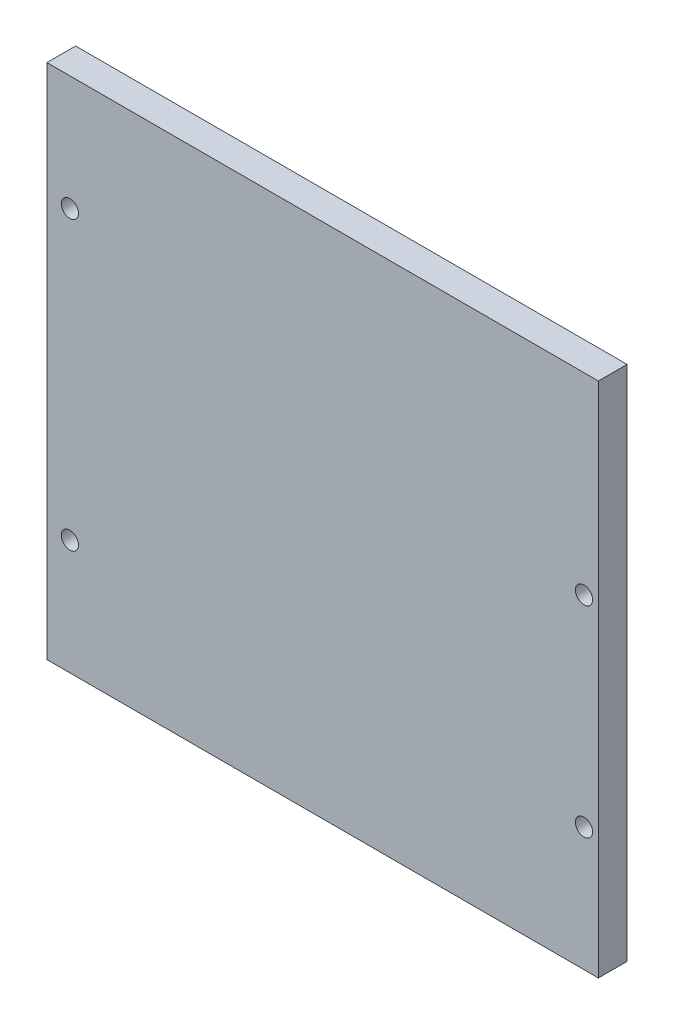
ISO-10303-21;
HEADER;
FILE_DESCRIPTION(('STEP AP214'),'2;1');
FILE_NAME('part.step','',(''),(''),'','','');
FILE_SCHEMA(('AUTOMOTIVE_DESIGN { 1 0 10303 214 1 1 1 1 }'));
ENDSEC;
DATA;
#1=APPLICATION_CONTEXT('core data for automotive mechanical design processes');
#2=APPLICATION_PROTOCOL_DEFINITION('international standard','automotive_design',2000,#1);
#3=PRODUCT_CONTEXT('',#1,'mechanical');
#4=PRODUCT('Part','Part','',(#3));
#5=PRODUCT_RELATED_PRODUCT_CATEGORY('part','',(#4));
#6=PRODUCT_DEFINITION_FORMATION('','',#4);
#7=PRODUCT_DEFINITION_CONTEXT('part definition',#1,'design');
#8=PRODUCT_DEFINITION('design','',#6,#7);
#9=PRODUCT_DEFINITION_SHAPE('','',#8);
#10=(LENGTH_UNIT() NAMED_UNIT(*) SI_UNIT(.MILLI.,.METRE.));
#11=(NAMED_UNIT(*) PLANE_ANGLE_UNIT() SI_UNIT($,.RADIAN.));
#12=(NAMED_UNIT(*) SI_UNIT($,.STERADIAN.) SOLID_ANGLE_UNIT());
#13=UNCERTAINTY_MEASURE_WITH_UNIT(LENGTH_MEASURE(1.E-05),#10,'distance_accuracy_value','');
#14=(GEOMETRIC_REPRESENTATION_CONTEXT(3) GLOBAL_UNCERTAINTY_ASSIGNED_CONTEXT((#13)) GLOBAL_UNIT_ASSIGNED_CONTEXT((#10,
#11,#12)) REPRESENTATION_CONTEXT('',''));
#15=CARTESIAN_POINT('',(0.,0.,0.));
#16=DIRECTION('',(0.,0.,1.));
#17=DIRECTION('',(1.,0.,0.));
#18=AXIS2_PLACEMENT_3D('',#15,#16,#17);
#19=CARTESIAN_POINT('',(48.,45.,5.));
#20=DIRECTION('',(-1.,0.,0.));
#21=DIRECTION('',(0.,-1.,0.));
#22=AXIS2_PLACEMENT_3D('',#19,#20,#21);
#23=PLANE('',#22);
#24=DIRECTION('',(0.,1.,0.));
#25=VECTOR('',#24,1.);
#26=CARTESIAN_POINT('',(48.,45.,0.));
#27=LINE('',#26,#25);
#28=CARTESIAN_POINT('',(48.,-45.,0.));
#29=VERTEX_POINT('',#28);
#30=CARTESIAN_POINT('',(48.,45.,0.));
#31=VERTEX_POINT('',#30);
#32=EDGE_CURVE('E107',#29,#31,#27,.T.);
#33=ORIENTED_EDGE('',*,*,#32,.T.);
#34=DIRECTION('',(0.,0.,-1.));
#35=VECTOR('',#34,1.);
#36=CARTESIAN_POINT('',(48.,45.,5.));
#37=LINE('',#36,#35);
#38=CARTESIAN_POINT('',(48.,45.,5.));
#39=VERTEX_POINT('',#38);
#40=EDGE_CURVE('E11',#39,#31,#37,.T.);
#41=ORIENTED_EDGE('',*,*,#40,.F.);
#42=DIRECTION('',(0.,1.,0.));
#43=VECTOR('',#42,1.);
#44=CARTESIAN_POINT('',(48.,45.,5.));
#45=LINE('',#44,#43);
#46=CARTESIAN_POINT('',(48.,-45.,5.));
#47=VERTEX_POINT('',#46);
#48=EDGE_CURVE('E91',#47,#39,#45,.T.);
#49=ORIENTED_EDGE('',*,*,#48,.F.);
#50=DIRECTION('',(0.,0.,-1.));
#51=VECTOR('',#50,1.);
#52=CARTESIAN_POINT('',(48.,-45.,5.));
#53=LINE('',#52,#51);
#54=EDGE_CURVE('E103',#47,#29,#53,.T.);
#55=ORIENTED_EDGE('',*,*,#54,.T.);
#56=EDGE_LOOP('',(#33,#41,#49,#55));
#57=FACE_BOUND('',#56,.T.);
#58=ADVANCED_FACE('F39',(#57),#23,.F.);
#59=CARTESIAN_POINT('',(-48.,45.,5.));
#60=DIRECTION('',(0.,-1.,0.));
#61=DIRECTION('',(0.,0.,-1.));
#62=AXIS2_PLACEMENT_3D('',#59,#60,#61);
#63=PLANE('',#62);
#64=DIRECTION('',(-1.,0.,0.));
#65=VECTOR('',#64,1.);
#66=CARTESIAN_POINT('',(-48.,45.,0.));
#67=LINE('',#66,#65);
#68=CARTESIAN_POINT('',(-48.,45.,0.));
#69=VERTEX_POINT('',#68);
#70=EDGE_CURVE('E96',#31,#69,#67,.T.);
#71=ORIENTED_EDGE('',*,*,#70,.T.);
#72=DIRECTION('',(0.,0.,-1.));
#73=VECTOR('',#72,1.);
#74=CARTESIAN_POINT('',(-48.,45.,5.));
#75=LINE('',#74,#73);
#76=CARTESIAN_POINT('',(-48.,45.,5.));
#77=VERTEX_POINT('',#76);
#78=EDGE_CURVE('E48',#77,#69,#75,.T.);
#79=ORIENTED_EDGE('',*,*,#78,.F.);
#80=DIRECTION('',(-1.,0.,0.));
#81=VECTOR('',#80,1.);
#82=CARTESIAN_POINT('',(-48.,45.,5.));
#83=LINE('',#82,#81);
#84=EDGE_CURVE('E86',#39,#77,#83,.T.);
#85=ORIENTED_EDGE('',*,*,#84,.F.);
#86=ORIENTED_EDGE('',*,*,#40,.T.);
#87=EDGE_LOOP('',(#71,#79,#85,#86));
#88=FACE_BOUND('',#87,.T.);
#89=ADVANCED_FACE('F95',(#88),#63,.F.);
#90=CARTESIAN_POINT('',(-48.,45.,5.));
#91=DIRECTION('',(1.,0.,0.));
#92=DIRECTION('',(0.,1.,0.));
#93=AXIS2_PLACEMENT_3D('',#90,#91,#92);
#94=PLANE('',#93);
#95=DIRECTION('',(0.,-1.,0.));
#96=VECTOR('',#95,1.);
#97=CARTESIAN_POINT('',(-48.,45.,0.));
#98=LINE('',#97,#96);
#99=CARTESIAN_POINT('',(-48.,-45.,0.));
#100=VERTEX_POINT('',#99);
#101=EDGE_CURVE('E73',#69,#100,#98,.T.);
#102=ORIENTED_EDGE('',*,*,#101,.T.);
#103=DIRECTION('',(0.,0.,-1.));
#104=VECTOR('',#103,1.);
#105=CARTESIAN_POINT('',(-48.,-45.,5.));
#106=LINE('',#105,#104);
#107=CARTESIAN_POINT('',(-48.,-45.,5.));
#108=VERTEX_POINT('',#107);
#109=EDGE_CURVE('E98',#108,#100,#106,.T.);
#110=ORIENTED_EDGE('',*,*,#109,.F.);
#111=DIRECTION('',(0.,-1.,0.));
#112=VECTOR('',#111,1.);
#113=CARTESIAN_POINT('',(-48.,45.,5.));
#114=LINE('',#113,#112);
#115=EDGE_CURVE('E89',#77,#108,#114,.T.);
#116=ORIENTED_EDGE('',*,*,#115,.F.);
#117=ORIENTED_EDGE('',*,*,#78,.T.);
#118=EDGE_LOOP('',(#102,#110,#116,#117));
#119=FACE_BOUND('',#118,.T.);
#120=ADVANCED_FACE('F99',(#119),#94,.F.);
#121=CARTESIAN_POINT('',(-48.,-45.,5.));
#122=DIRECTION('',(0.,1.,0.));
#123=DIRECTION('',(0.,0.,1.));
#124=AXIS2_PLACEMENT_3D('',#121,#122,#123);
#125=PLANE('',#124);
#126=DIRECTION('',(1.,0.,0.));
#127=VECTOR('',#126,1.);
#128=CARTESIAN_POINT('',(-48.,-45.,0.));
#129=LINE('',#128,#127);
#130=EDGE_CURVE('E79',#100,#29,#129,.T.);
#131=ORIENTED_EDGE('',*,*,#130,.T.);
#132=ORIENTED_EDGE('',*,*,#54,.F.);
#133=DIRECTION('',(1.,0.,0.));
#134=VECTOR('',#133,1.);
#135=CARTESIAN_POINT('',(-48.,-45.,5.));
#136=LINE('',#135,#134);
#137=EDGE_CURVE('E56',#108,#47,#136,.T.);
#138=ORIENTED_EDGE('',*,*,#137,.F.);
#139=ORIENTED_EDGE('',*,*,#109,.T.);
#140=EDGE_LOOP('',(#131,#132,#138,#139));
#141=FACE_BOUND('',#140,.T.);
#142=ADVANCED_FACE('F121',(#141),#125,.F.);
#143=CARTESIAN_POINT('',(0.,0.,5.));
#144=DIRECTION('',(0.,0.,1.));
#145=DIRECTION('',(1.,0.,0.));
#146=AXIS2_PLACEMENT_3D('',#143,#144,#145);
#147=PLANE('',#146);
#148=CARTESIAN_POINT('',(-44.,25.,5.));
#149=DIRECTION('',(0.,0.,1.));
#150=DIRECTION('',(1.,0.,0.));
#151=AXIS2_PLACEMENT_3D('',#148,#149,#150);
#152=CIRCLE('',#151,1.5);
#153=CARTESIAN_POINT('',(-42.5,25.,5.));
#154=VERTEX_POINT('',#153);
#155=EDGE_CURVE('E152',#154,#154,#152,.T.);
#156=ORIENTED_EDGE('',*,*,#155,.F.);
#157=EDGE_LOOP('',(#156));
#158=FACE_BOUND('',#157,.T.);
#159=CARTESIAN_POINT('',(-44.,-25.,5.));
#160=DIRECTION('',(0.,0.,1.));
#161=DIRECTION('',(1.,0.,0.));
#162=AXIS2_PLACEMENT_3D('',#159,#160,#161);
#163=CIRCLE('',#162,1.5);
#164=CARTESIAN_POINT('',(-42.5,-25.,5.));
#165=VERTEX_POINT('',#164);
#166=EDGE_CURVE('E144',#165,#165,#163,.T.);
#167=ORIENTED_EDGE('',*,*,#166,.F.);
#168=EDGE_LOOP('',(#167));
#169=FACE_BOUND('',#168,.T.);
#170=CARTESIAN_POINT('',(45.5,11.5,5.));
#171=DIRECTION('',(0.,0.,1.));
#172=DIRECTION('',(1.,0.,0.));
#173=AXIS2_PLACEMENT_3D('',#170,#171,#172);
#174=CIRCLE('',#173,1.5);
#175=CARTESIAN_POINT('',(47.,11.5,5.));
#176=VERTEX_POINT('',#175);
#177=EDGE_CURVE('E137',#176,#176,#174,.T.);
#178=ORIENTED_EDGE('',*,*,#177,.F.);
#179=EDGE_LOOP('',(#178));
#180=FACE_BOUND('',#179,.T.);
#181=CARTESIAN_POINT('',(45.5,-23.5,5.));
#182=DIRECTION('',(0.,0.,1.));
#183=DIRECTION('',(1.,0.,0.));
#184=AXIS2_PLACEMENT_3D('',#181,#182,#183);
#185=CIRCLE('',#184,1.5);
#186=CARTESIAN_POINT('',(47.,-23.5,5.));
#187=VERTEX_POINT('',#186);
#188=EDGE_CURVE('E128',#187,#187,#185,.T.);
#189=ORIENTED_EDGE('',*,*,#188,.F.);
#190=EDGE_LOOP('',(#189));
#191=FACE_BOUND('',#190,.T.);
#192=ORIENTED_EDGE('',*,*,#48,.T.);
#193=ORIENTED_EDGE('',*,*,#84,.T.);
#194=ORIENTED_EDGE('',*,*,#115,.T.);
#195=ORIENTED_EDGE('',*,*,#137,.T.);
#196=EDGE_LOOP('',(#192,#193,#194,#195));
#197=FACE_BOUND('',#196,.T.);
#198=ADVANCED_FACE('F87',(#158,#169,#180,#191,#197),#147,.T.);
#199=CARTESIAN_POINT('',(0.,0.,0.));
#200=DIRECTION('',(0.,0.,1.));
#201=DIRECTION('',(1.,0.,0.));
#202=AXIS2_PLACEMENT_3D('',#199,#200,#201);
#203=PLANE('',#202);
#204=CARTESIAN_POINT('',(-44.,25.,0.));
#205=DIRECTION('',(0.,0.,1.));
#206=DIRECTION('',(1.,0.,0.));
#207=AXIS2_PLACEMENT_3D('',#204,#205,#206);
#208=CIRCLE('',#207,1.5);
#209=CARTESIAN_POINT('',(-42.5,25.,0.));
#210=VERTEX_POINT('',#209);
#211=EDGE_CURVE('E133',#210,#210,#208,.T.);
#212=ORIENTED_EDGE('',*,*,#211,.T.);
#213=EDGE_LOOP('',(#212));
#214=FACE_BOUND('',#213,.T.);
#215=CARTESIAN_POINT('',(-44.,-25.,0.));
#216=DIRECTION('',(0.,0.,1.));
#217=DIRECTION('',(1.,0.,0.));
#218=AXIS2_PLACEMENT_3D('',#215,#216,#217);
#219=CIRCLE('',#218,1.5);
#220=CARTESIAN_POINT('',(-42.5,-25.,0.));
#221=VERTEX_POINT('',#220);
#222=EDGE_CURVE('E148',#221,#221,#219,.T.);
#223=ORIENTED_EDGE('',*,*,#222,.T.);
#224=EDGE_LOOP('',(#223));
#225=FACE_BOUND('',#224,.T.);
#226=CARTESIAN_POINT('',(45.5,11.5,0.));
#227=DIRECTION('',(0.,0.,1.));
#228=DIRECTION('',(1.,0.,0.));
#229=AXIS2_PLACEMENT_3D('',#226,#227,#228);
#230=CIRCLE('',#229,1.5);
#231=CARTESIAN_POINT('',(47.,11.5,0.));
#232=VERTEX_POINT('',#231);
#233=EDGE_CURVE('E111',#232,#232,#230,.T.);
#234=ORIENTED_EDGE('',*,*,#233,.T.);
#235=EDGE_LOOP('',(#234));
#236=FACE_BOUND('',#235,.T.);
#237=CARTESIAN_POINT('',(45.5,-23.5,0.));
#238=DIRECTION('',(0.,0.,1.));
#239=DIRECTION('',(1.,0.,0.));
#240=AXIS2_PLACEMENT_3D('',#237,#238,#239);
#241=CIRCLE('',#240,1.5);
#242=CARTESIAN_POINT('',(47.,-23.5,0.));
#243=VERTEX_POINT('',#242);
#244=EDGE_CURVE('E132',#243,#243,#241,.T.);
#245=ORIENTED_EDGE('',*,*,#244,.T.);
#246=EDGE_LOOP('',(#245));
#247=FACE_BOUND('',#246,.T.);
#248=ORIENTED_EDGE('',*,*,#32,.F.);
#249=ORIENTED_EDGE('',*,*,#130,.F.);
#250=ORIENTED_EDGE('',*,*,#101,.F.);
#251=ORIENTED_EDGE('',*,*,#70,.F.);
#252=EDGE_LOOP('',(#248,#249,#250,#251));
#253=FACE_BOUND('',#252,.T.);
#254=ADVANCED_FACE('F124',(#214,#225,#236,#247,#253),#203,.F.);
#255=CARTESIAN_POINT('',(45.5,-23.5,0.));
#256=DIRECTION('',(0.,0.,1.));
#257=DIRECTION('',(1.,0.,0.));
#258=AXIS2_PLACEMENT_3D('',#255,#256,#257);
#259=CYLINDRICAL_SURFACE('',#258,1.5);
#260=ORIENTED_EDGE('',*,*,#244,.F.);
#261=EDGE_LOOP('',(#260));
#262=FACE_BOUND('',#261,.T.);
#263=ORIENTED_EDGE('',*,*,#188,.T.);
#264=EDGE_LOOP('',(#263));
#265=FACE_BOUND('',#264,.T.);
#266=ADVANCED_FACE('F178',(#262,#265),#259,.F.);
#267=CARTESIAN_POINT('',(45.5,11.5,0.));
#268=DIRECTION('',(0.,0.,1.));
#269=DIRECTION('',(1.,0.,0.));
#270=AXIS2_PLACEMENT_3D('',#267,#268,#269);
#271=CYLINDRICAL_SURFACE('',#270,1.5);
#272=ORIENTED_EDGE('',*,*,#233,.F.);
#273=EDGE_LOOP('',(#272));
#274=FACE_BOUND('',#273,.T.);
#275=ORIENTED_EDGE('',*,*,#177,.T.);
#276=EDGE_LOOP('',(#275));
#277=FACE_BOUND('',#276,.T.);
#278=ADVANCED_FACE('F180',(#274,#277),#271,.F.);
#279=CARTESIAN_POINT('',(-44.,-25.,0.));
#280=DIRECTION('',(0.,0.,1.));
#281=DIRECTION('',(1.,0.,0.));
#282=AXIS2_PLACEMENT_3D('',#279,#280,#281);
#283=CYLINDRICAL_SURFACE('',#282,1.5);
#284=ORIENTED_EDGE('',*,*,#222,.F.);
#285=EDGE_LOOP('',(#284));
#286=FACE_BOUND('',#285,.T.);
#287=ORIENTED_EDGE('',*,*,#166,.T.);
#288=EDGE_LOOP('',(#287));
#289=FACE_BOUND('',#288,.T.);
#290=ADVANCED_FACE('F165',(#286,#289),#283,.F.);
#291=CARTESIAN_POINT('',(-44.,25.,0.));
#292=DIRECTION('',(0.,0.,1.));
#293=DIRECTION('',(1.,0.,0.));
#294=AXIS2_PLACEMENT_3D('',#291,#292,#293);
#295=CYLINDRICAL_SURFACE('',#294,1.5);
#296=ORIENTED_EDGE('',*,*,#211,.F.);
#297=EDGE_LOOP('',(#296));
#298=FACE_BOUND('',#297,.T.);
#299=ORIENTED_EDGE('',*,*,#155,.T.);
#300=EDGE_LOOP('',(#299));
#301=FACE_BOUND('',#300,.T.);
#302=ADVANCED_FACE('F162',(#298,#301),#295,.F.);
#303=CLOSED_SHELL('',(#58,#89,#120,#142,#198,#254,#266,#278,#290,#302));
#304=MANIFOLD_SOLID_BREP('B2',#303);
#305=ADVANCED_BREP_SHAPE_REPRESENTATION('',(#18,#304),#14);
#306=SHAPE_DEFINITION_REPRESENTATION(#9,#305);
ENDSEC;
END-ISO-10303-21;
